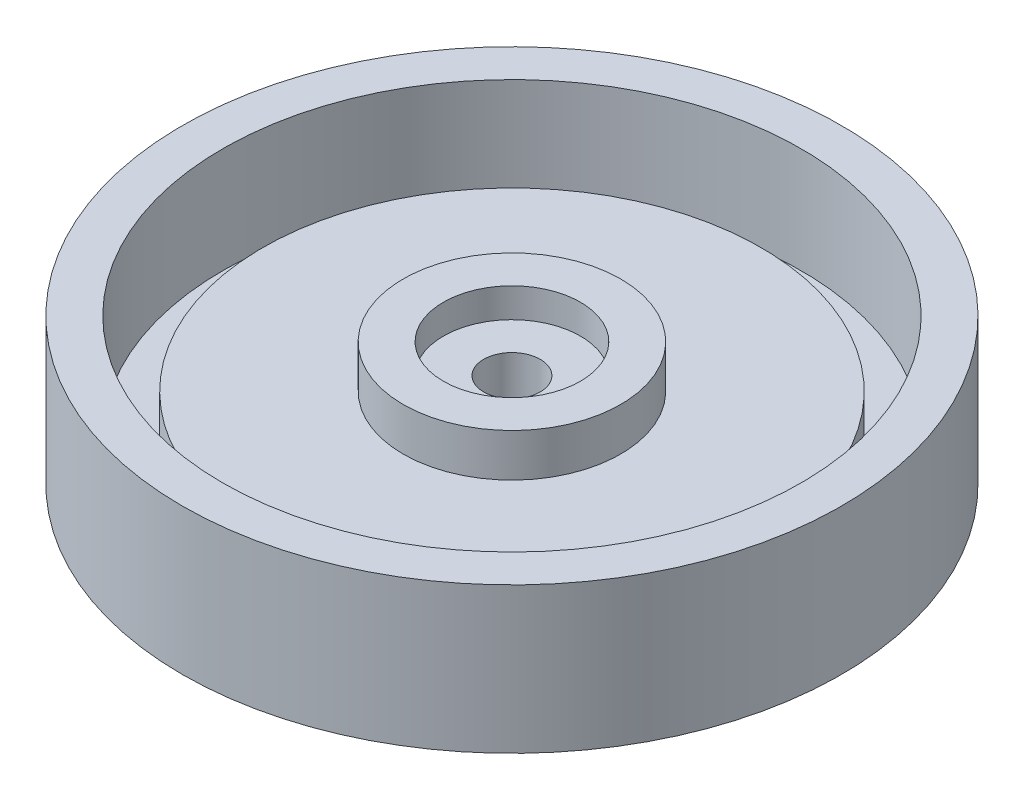
ISO-10303-21;
HEADER;
FILE_DESCRIPTION(('STEP AP214'),'2;1');
FILE_NAME('part.step','',(''),(''),'','','');
FILE_SCHEMA(('AUTOMOTIVE_DESIGN { 1 0 10303 214 1 1 1 1 }'));
ENDSEC;
DATA;
#1=APPLICATION_CONTEXT('core data for automotive mechanical design processes');
#2=APPLICATION_PROTOCOL_DEFINITION('international standard','automotive_design',2000,#1);
#3=PRODUCT_CONTEXT('',#1,'mechanical');
#4=PRODUCT('Part','Part','',(#3));
#5=PRODUCT_RELATED_PRODUCT_CATEGORY('part','',(#4));
#6=PRODUCT_DEFINITION_FORMATION('','',#4);
#7=PRODUCT_DEFINITION_CONTEXT('part definition',#1,'design');
#8=PRODUCT_DEFINITION('design','',#6,#7);
#9=PRODUCT_DEFINITION_SHAPE('','',#8);
#10=(LENGTH_UNIT() NAMED_UNIT(*) SI_UNIT(.MILLI.,.METRE.));
#11=(NAMED_UNIT(*) PLANE_ANGLE_UNIT() SI_UNIT($,.RADIAN.));
#12=(NAMED_UNIT(*) SI_UNIT($,.STERADIAN.) SOLID_ANGLE_UNIT());
#13=UNCERTAINTY_MEASURE_WITH_UNIT(LENGTH_MEASURE(1.E-05),#10,'distance_accuracy_value','');
#14=(GEOMETRIC_REPRESENTATION_CONTEXT(3) GLOBAL_UNCERTAINTY_ASSIGNED_CONTEXT((#13)) GLOBAL_UNIT_ASSIGNED_CONTEXT((#10,
#11,#12)) REPRESENTATION_CONTEXT('',''));
#15=CARTESIAN_POINT('',(0.,0.,0.));
#16=DIRECTION('',(0.,0.,1.));
#17=DIRECTION('',(1.,0.,0.));
#18=AXIS2_PLACEMENT_3D('',#15,#16,#17);
#19=CARTESIAN_POINT('',(0.,-9.36701831976429,0.));
#20=DIRECTION('',(0.,1.,0.));
#21=DIRECTION('',(0.,0.,1.));
#22=AXIS2_PLACEMENT_3D('',#19,#20,#21);
#23=PLANE('',#22);
#24=CARTESIAN_POINT('',(0.,-9.36701831976429,0.));
#25=DIRECTION('',(0.,1.,0.));
#26=DIRECTION('',(0.,0.,1.));
#27=AXIS2_PLACEMENT_3D('',#24,#25,#26);
#28=CIRCLE('',#27,35.2783806848266);
#29=CARTESIAN_POINT('',(0.,-9.36701831976429,35.2783806848266));
#30=VERTEX_POINT('',#29);
#31=EDGE_CURVE('E10',#30,#30,#28,.T.);
#32=ORIENTED_EDGE('',*,*,#31,.F.);
#33=EDGE_LOOP('',(#32));
#34=FACE_BOUND('',#33,.T.);
#35=ADVANCED_FACE('F35',(#34),#23,.F.);
#36=CARTESIAN_POINT('',(0.,108.161755845979,0.));
#37=DIRECTION('',(0.,1.,0.));
#38=DIRECTION('',(0.,0.,1.));
#39=AXIS2_PLACEMENT_3D('',#36,#37,#38);
#40=CYLINDRICAL_SURFACE('',#39,35.2783806848266);
#41=CARTESIAN_POINT('',(0.,0.,0.));
#42=DIRECTION('',(0.,1.,0.));
#43=DIRECTION('',(0.,0.,1.));
#44=AXIS2_PLACEMENT_3D('',#41,#42,#43);
#45=CIRCLE('',#44,35.2783806848266);
#46=CARTESIAN_POINT('',(0.,0.,35.2783806848266));
#47=VERTEX_POINT('',#46);
#48=EDGE_CURVE('E41',#47,#47,#45,.T.);
#49=ORIENTED_EDGE('',*,*,#48,.F.);
#50=EDGE_LOOP('',(#49));
#51=FACE_BOUND('',#50,.T.);
#52=ORIENTED_EDGE('',*,*,#31,.T.);
#53=EDGE_LOOP('',(#52));
#54=FACE_BOUND('',#53,.T.);
#55=ADVANCED_FACE('F155',(#51,#54),#40,.T.);
#56=CARTESIAN_POINT('',(35.2783806848266,0.,0.));
#57=DIRECTION('',(0.,1.,0.));
#58=DIRECTION('',(0.,0.,1.));
#59=AXIS2_PLACEMENT_3D('',#56,#57,#58);
#60=PLANE('',#59);
#61=CARTESIAN_POINT('',(0.,0.,0.));
#62=DIRECTION('',(0.,1.,0.));
#63=DIRECTION('',(0.,0.,1.));
#64=AXIS2_PLACEMENT_3D('',#61,#62,#63);
#65=CIRCLE('',#64,73.7155115643123);
#66=CARTESIAN_POINT('',(0.,0.,73.7155115643123));
#67=VERTEX_POINT('',#66);
#68=EDGE_CURVE('E45',#67,#67,#65,.T.);
#69=ORIENTED_EDGE('',*,*,#68,.F.);
#70=EDGE_LOOP('',(#69));
#71=FACE_BOUND('',#70,.T.);
#72=ORIENTED_EDGE('',*,*,#48,.T.);
#73=EDGE_LOOP('',(#72));
#74=FACE_BOUND('',#73,.T.);
#75=ADVANCED_FACE('F150',(#71,#74),#60,.F.);
#76=CARTESIAN_POINT('',(0.,108.161755845979,0.));
#77=DIRECTION('',(0.,1.,0.));
#78=DIRECTION('',(0.,0.,1.));
#79=AXIS2_PLACEMENT_3D('',#76,#77,#78);
#80=CYLINDRICAL_SURFACE('',#79,73.7155115643123);
#81=CARTESIAN_POINT('',(0.,32.6329816802357,0.));
#82=DIRECTION('',(0.,1.,0.));
#83=DIRECTION('',(0.,0.,1.));
#84=AXIS2_PLACEMENT_3D('',#81,#82,#83);
#85=CIRCLE('',#84,73.7155115643123);
#86=CARTESIAN_POINT('',(0.,32.6329816802357,73.7155115643123));
#87=VERTEX_POINT('',#86);
#88=EDGE_CURVE('E49',#87,#87,#85,.T.);
#89=ORIENTED_EDGE('',*,*,#88,.F.);
#90=EDGE_LOOP('',(#89));
#91=FACE_BOUND('',#90,.T.);
#92=ORIENTED_EDGE('',*,*,#68,.T.);
#93=EDGE_LOOP('',(#92));
#94=FACE_BOUND('',#93,.T.);
#95=ADVANCED_FACE('F144',(#91,#94),#80,.T.);
#96=CARTESIAN_POINT('',(73.7155115643123,32.6329816802357,0.));
#97=DIRECTION('',(0.,-1.,0.));
#98=DIRECTION('',(0.,0.,-1.));
#99=AXIS2_PLACEMENT_3D('',#96,#97,#98);
#100=PLANE('',#99);
#101=CARTESIAN_POINT('',(0.,32.6329816802357,0.));
#102=DIRECTION('',(0.,1.,0.));
#103=DIRECTION('',(0.,0.,1.));
#104=AXIS2_PLACEMENT_3D('',#101,#102,#103);
#105=CIRCLE('',#104,64.7155115643123);
#106=CARTESIAN_POINT('',(0.,32.6329816802357,64.7155115643123));
#107=VERTEX_POINT('',#106);
#108=EDGE_CURVE('E54',#107,#107,#105,.T.);
#109=ORIENTED_EDGE('',*,*,#108,.F.);
#110=EDGE_LOOP('',(#109));
#111=FACE_BOUND('',#110,.T.);
#112=ORIENTED_EDGE('',*,*,#88,.T.);
#113=EDGE_LOOP('',(#112));
#114=FACE_BOUND('',#113,.T.);
#115=ADVANCED_FACE('F138',(#111,#114),#100,.F.);
#116=CARTESIAN_POINT('',(0.,108.161755845979,0.));
#117=DIRECTION('',(0.,1.,0.));
#118=DIRECTION('',(0.,0.,1.));
#119=AXIS2_PLACEMENT_3D('',#116,#117,#118);
#120=CYLINDRICAL_SURFACE('',#119,64.7155115643123);
#121=CARTESIAN_POINT('',(0.,8.99999999999999,0.));
#122=DIRECTION('',(0.,1.,0.));
#123=DIRECTION('',(0.,0.,1.));
#124=AXIS2_PLACEMENT_3D('',#121,#122,#123);
#125=CIRCLE('',#124,64.7155115643123);
#126=CARTESIAN_POINT('',(0.,8.99999999999999,64.7155115643123));
#127=VERTEX_POINT('',#126);
#128=EDGE_CURVE('E57',#127,#127,#125,.T.);
#129=ORIENTED_EDGE('',*,*,#128,.F.);
#130=EDGE_LOOP('',(#129));
#131=FACE_BOUND('',#130,.T.);
#132=ORIENTED_EDGE('',*,*,#108,.T.);
#133=EDGE_LOOP('',(#132));
#134=FACE_BOUND('',#133,.T.);
#135=ADVANCED_FACE('F132',(#131,#134),#120,.F.);
#136=CARTESIAN_POINT('',(64.7155115643123,9.,0.));
#137=DIRECTION('',(0.,-1.,0.));
#138=DIRECTION('',(0.,0.,-1.));
#139=AXIS2_PLACEMENT_3D('',#136,#137,#138);
#140=PLANE('',#139);
#141=CARTESIAN_POINT('',(0.,8.99999999999999,0.));
#142=DIRECTION('',(0.,1.,0.));
#143=DIRECTION('',(0.,0.,1.));
#144=AXIS2_PLACEMENT_3D('',#141,#142,#143);
#145=CIRCLE('',#144,55.7155115643123);
#146=CARTESIAN_POINT('',(0.,8.99999999999999,55.7155115643123));
#147=VERTEX_POINT('',#146);
#148=EDGE_CURVE('E60',#147,#147,#145,.T.);
#149=ORIENTED_EDGE('',*,*,#148,.F.);
#150=EDGE_LOOP('',(#149));
#151=FACE_BOUND('',#150,.T.);
#152=ORIENTED_EDGE('',*,*,#128,.T.);
#153=EDGE_LOOP('',(#152));
#154=FACE_BOUND('',#153,.T.);
#155=ADVANCED_FACE('F126',(#151,#154),#140,.F.);
#156=CARTESIAN_POINT('',(0.,108.161755845979,0.));
#157=DIRECTION('',(0.,1.,0.));
#158=DIRECTION('',(0.,0.,1.));
#159=AXIS2_PLACEMENT_3D('',#156,#157,#158);
#160=CYLINDRICAL_SURFACE('',#159,55.7155115643123);
#161=CARTESIAN_POINT('',(0.,18.,0.));
#162=DIRECTION('',(0.,1.,0.));
#163=DIRECTION('',(0.,0.,1.));
#164=AXIS2_PLACEMENT_3D('',#161,#162,#163);
#165=CIRCLE('',#164,55.7155115643123);
#166=CARTESIAN_POINT('',(0.,18.,55.7155115643123));
#167=VERTEX_POINT('',#166);
#168=EDGE_CURVE('E63',#167,#167,#165,.T.);
#169=ORIENTED_EDGE('',*,*,#168,.F.);
#170=EDGE_LOOP('',(#169));
#171=FACE_BOUND('',#170,.T.);
#172=ORIENTED_EDGE('',*,*,#148,.T.);
#173=EDGE_LOOP('',(#172));
#174=FACE_BOUND('',#173,.T.);
#175=ADVANCED_FACE('F120',(#171,#174),#160,.T.);
#176=CARTESIAN_POINT('',(55.7155115643123,18.,0.));
#177=DIRECTION('',(0.,-1.,0.));
#178=DIRECTION('',(0.,0.,-1.));
#179=AXIS2_PLACEMENT_3D('',#176,#177,#178);
#180=PLANE('',#179);
#181=CARTESIAN_POINT('',(0.,18.,0.));
#182=DIRECTION('',(0.,1.,0.));
#183=DIRECTION('',(0.,0.,1.));
#184=AXIS2_PLACEMENT_3D('',#181,#182,#183);
#185=CIRCLE('',#184,24.3257786055551);
#186=CARTESIAN_POINT('',(0.,18.,24.3257786055551));
#187=VERTEX_POINT('',#186);
#188=EDGE_CURVE('E66',#187,#187,#185,.T.);
#189=ORIENTED_EDGE('',*,*,#188,.F.);
#190=EDGE_LOOP('',(#189));
#191=FACE_BOUND('',#190,.T.);
#192=ORIENTED_EDGE('',*,*,#168,.T.);
#193=EDGE_LOOP('',(#192));
#194=FACE_BOUND('',#193,.T.);
#195=ADVANCED_FACE('F114',(#191,#194),#180,.F.);
#196=CARTESIAN_POINT('',(0.,108.161755845979,0.));
#197=DIRECTION('',(0.,1.,0.));
#198=DIRECTION('',(0.,0.,1.));
#199=AXIS2_PLACEMENT_3D('',#196,#197,#198);
#200=CYLINDRICAL_SURFACE('',#199,24.3257786055551);
#201=CARTESIAN_POINT('',(0.,27.6144566050194,0.));
#202=DIRECTION('',(0.,1.,0.));
#203=DIRECTION('',(0.,0.,1.));
#204=AXIS2_PLACEMENT_3D('',#201,#202,#203);
#205=CIRCLE('',#204,24.3257786055551);
#206=CARTESIAN_POINT('',(0.,27.6144566050194,24.3257786055551));
#207=VERTEX_POINT('',#206);
#208=EDGE_CURVE('E69',#207,#207,#205,.T.);
#209=ORIENTED_EDGE('',*,*,#208,.F.);
#210=EDGE_LOOP('',(#209));
#211=FACE_BOUND('',#210,.T.);
#212=ORIENTED_EDGE('',*,*,#188,.T.);
#213=EDGE_LOOP('',(#212));
#214=FACE_BOUND('',#213,.T.);
#215=ADVANCED_FACE('F108',(#211,#214),#200,.T.);
#216=CARTESIAN_POINT('',(24.3257786055551,27.6144566050194,0.));
#217=DIRECTION('',(0.,-1.,0.));
#218=DIRECTION('',(0.,0.,-1.));
#219=AXIS2_PLACEMENT_3D('',#216,#217,#218);
#220=PLANE('',#219);
#221=CARTESIAN_POINT('',(0.,27.6144566050194,0.));
#222=DIRECTION('',(0.,1.,0.));
#223=DIRECTION('',(0.,0.,1.));
#224=AXIS2_PLACEMENT_3D('',#221,#222,#223);
#225=CIRCLE('',#224,15.3257786055551);
#226=CARTESIAN_POINT('',(0.,27.6144566050194,15.3257786055551));
#227=VERTEX_POINT('',#226);
#228=EDGE_CURVE('E72',#227,#227,#225,.T.);
#229=ORIENTED_EDGE('',*,*,#228,.F.);
#230=EDGE_LOOP('',(#229));
#231=FACE_BOUND('',#230,.T.);
#232=ORIENTED_EDGE('',*,*,#208,.T.);
#233=EDGE_LOOP('',(#232));
#234=FACE_BOUND('',#233,.T.);
#235=ADVANCED_FACE('F102',(#231,#234),#220,.F.);
#236=CARTESIAN_POINT('',(0.,108.161755845979,0.));
#237=DIRECTION('',(0.,1.,0.));
#238=DIRECTION('',(0.,0.,1.));
#239=AXIS2_PLACEMENT_3D('',#236,#237,#238);
#240=CYLINDRICAL_SURFACE('',#239,15.3257786055551);
#241=CARTESIAN_POINT('',(0.,21.0453788223276,0.));
#242=DIRECTION('',(0.,1.,0.));
#243=DIRECTION('',(0.,0.,1.));
#244=AXIS2_PLACEMENT_3D('',#241,#242,#243);
#245=CIRCLE('',#244,15.3257786055551);
#246=CARTESIAN_POINT('',(0.,21.0453788223276,15.3257786055551));
#247=VERTEX_POINT('',#246);
#248=EDGE_CURVE('E75',#247,#247,#245,.T.);
#249=ORIENTED_EDGE('',*,*,#248,.F.);
#250=EDGE_LOOP('',(#249));
#251=FACE_BOUND('',#250,.T.);
#252=ORIENTED_EDGE('',*,*,#228,.T.);
#253=EDGE_LOOP('',(#252));
#254=FACE_BOUND('',#253,.T.);
#255=ADVANCED_FACE('F96',(#251,#254),#240,.F.);
#256=CARTESIAN_POINT('',(6.32577860555511,21.0453788223276,0.));
#257=DIRECTION('',(0.,-1.,0.));
#258=DIRECTION('',(0.,0.,-1.));
#259=AXIS2_PLACEMENT_3D('',#256,#257,#258);
#260=PLANE('',#259);
#261=CARTESIAN_POINT('',(0.,21.0453788223276,0.));
#262=DIRECTION('',(0.,1.,0.));
#263=DIRECTION('',(0.,0.,1.));
#264=AXIS2_PLACEMENT_3D('',#261,#262,#263);
#265=CIRCLE('',#264,6.32577860555511);
#266=CARTESIAN_POINT('',(0.,21.0453788223276,6.32577860555511));
#267=VERTEX_POINT('',#266);
#268=EDGE_CURVE('E78',#267,#267,#265,.T.);
#269=ORIENTED_EDGE('',*,*,#268,.F.);
#270=EDGE_LOOP('',(#269));
#271=FACE_BOUND('',#270,.T.);
#272=ORIENTED_EDGE('',*,*,#248,.T.);
#273=EDGE_LOOP('',(#272));
#274=FACE_BOUND('',#273,.T.);
#275=ADVANCED_FACE('F90',(#271,#274),#260,.F.);
#276=CARTESIAN_POINT('',(0.,108.161755845979,0.));
#277=DIRECTION('',(0.,1.,0.));
#278=DIRECTION('',(0.,0.,1.));
#279=AXIS2_PLACEMENT_3D('',#276,#277,#278);
#280=CYLINDRICAL_SURFACE('',#279,6.32577860555511);
#281=CARTESIAN_POINT('',(0.,0.,0.));
#282=DIRECTION('',(0.,1.,0.));
#283=DIRECTION('',(0.,0.,1.));
#284=AXIS2_PLACEMENT_3D('',#281,#282,#283);
#285=CIRCLE('',#284,6.32577860555511);
#286=CARTESIAN_POINT('',(0.,0.,6.32577860555511));
#287=VERTEX_POINT('',#286);
#288=EDGE_CURVE('E81',#287,#287,#285,.T.);
#289=ORIENTED_EDGE('',*,*,#288,.F.);
#290=EDGE_LOOP('',(#289));
#291=FACE_BOUND('',#290,.T.);
#292=ORIENTED_EDGE('',*,*,#268,.T.);
#293=EDGE_LOOP('',(#292));
#294=FACE_BOUND('',#293,.T.);
#295=ADVANCED_FACE('F87',(#291,#294),#280,.F.);
#296=CARTESIAN_POINT('',(6.32577860555511,0.,0.));
#297=DIRECTION('',(0.,-1.,0.));
#298=DIRECTION('',(0.,0.,-1.));
#299=AXIS2_PLACEMENT_3D('',#296,#297,#298);
#300=PLANE('',#299);
#301=ORIENTED_EDGE('',*,*,#288,.T.);
#302=EDGE_LOOP('',(#301));
#303=FACE_BOUND('',#302,.T.);
#304=ADVANCED_FACE('F85',(#303),#300,.F.);
#305=CLOSED_SHELL('',(#35,#55,#75,#95,#115,#135,#155,#175,#195,#215,#235,#255,#275,#295,#304));
#306=MANIFOLD_SOLID_BREP('B2',#305);
#307=ADVANCED_BREP_SHAPE_REPRESENTATION('',(#18,#306),#14);
#308=SHAPE_DEFINITION_REPRESENTATION(#9,#307);
ENDSEC;
END-ISO-10303-21;
